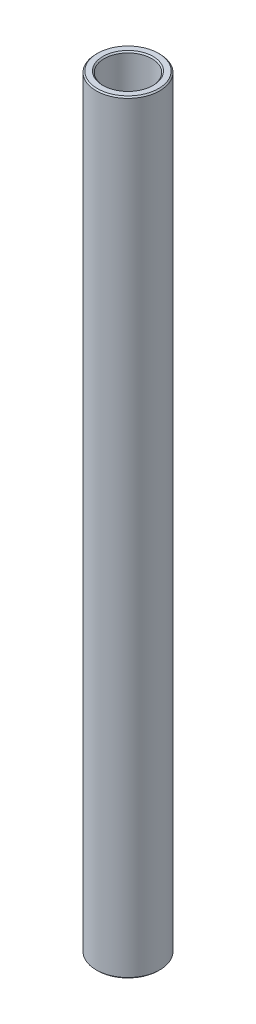
ISO-10303-21;
HEADER;
FILE_DESCRIPTION(('STEP AP214'),'2;1');
FILE_NAME('part.step','',(''),(''),'','','');
FILE_SCHEMA(('AUTOMOTIVE_DESIGN { 1 0 10303 214 1 1 1 1 }'));
ENDSEC;
DATA;
#1=APPLICATION_CONTEXT('core data for automotive mechanical design processes');
#2=APPLICATION_PROTOCOL_DEFINITION('international standard','automotive_design',2000,#1);
#3=PRODUCT_CONTEXT('',#1,'mechanical');
#4=PRODUCT('Part','Part','',(#3));
#5=PRODUCT_RELATED_PRODUCT_CATEGORY('part','',(#4));
#6=PRODUCT_DEFINITION_FORMATION('','',#4);
#7=PRODUCT_DEFINITION_CONTEXT('part definition',#1,'design');
#8=PRODUCT_DEFINITION('design','',#6,#7);
#9=PRODUCT_DEFINITION_SHAPE('','',#8);
#10=(LENGTH_UNIT() NAMED_UNIT(*) SI_UNIT(.MILLI.,.METRE.));
#11=(NAMED_UNIT(*) PLANE_ANGLE_UNIT() SI_UNIT($,.RADIAN.));
#12=(NAMED_UNIT(*) SI_UNIT($,.STERADIAN.) SOLID_ANGLE_UNIT());
#13=UNCERTAINTY_MEASURE_WITH_UNIT(LENGTH_MEASURE(1.E-05),#10,'distance_accuracy_value','');
#14=(GEOMETRIC_REPRESENTATION_CONTEXT(3) GLOBAL_UNCERTAINTY_ASSIGNED_CONTEXT((#13)) GLOBAL_UNIT_ASSIGNED_CONTEXT((#10,
#11,#12)) REPRESENTATION_CONTEXT('',''));
#15=CARTESIAN_POINT('',(0.,0.,0.));
#16=DIRECTION('',(0.,0.,1.));
#17=DIRECTION('',(1.,0.,0.));
#18=AXIS2_PLACEMENT_3D('',#15,#16,#17);
#19=CARTESIAN_POINT('',(0.,11.60859375,0.));
#20=DIRECTION('',(0.,1.,0.));
#21=DIRECTION('',(-1.,0.,0.));
#22=AXIS2_PLACEMENT_3D('',#19,#20,#21);
#23=CYLINDRICAL_SURFACE('',#22,4.76250000000001);
#24=CARTESIAN_POINT('',(0.,-75.946,0.));
#25=DIRECTION('',(0.,1.,0.));
#26=DIRECTION('',(-1.,0.,0.));
#27=AXIS2_PLACEMENT_3D('',#24,#25,#26);
#28=CIRCLE('',#27,4.76250000000001);
#29=CARTESIAN_POINT('',(-4.76250000000002,-75.946,0.));
#30=VERTEX_POINT('',#29);
#31=EDGE_CURVE('E51',#30,#30,#28,.F.);
#32=ORIENTED_EDGE('',*,*,#31,.T.);
#33=EDGE_LOOP('',(#32));
#34=FACE_BOUND('',#33,.T.);
#35=CARTESIAN_POINT('',(0.,75.9460000000001,0.));
#36=DIRECTION('',(0.,-1.,0.));
#37=DIRECTION('',(1.,0.,0.));
#38=AXIS2_PLACEMENT_3D('',#35,#36,#37);
#39=CIRCLE('',#38,4.76250000000001);
#40=CARTESIAN_POINT('',(4.76250000000002,75.9460000000001,0.));
#41=VERTEX_POINT('',#40);
#42=EDGE_CURVE('E54',#41,#41,#39,.F.);
#43=ORIENTED_EDGE('',*,*,#42,.T.);
#44=EDGE_LOOP('',(#43));
#45=FACE_BOUND('',#44,.T.);
#46=ADVANCED_FACE('F31',(#34,#45),#23,.F.);
#47=CARTESIAN_POINT('',(4.7625,76.2,0.));
#48=DIRECTION('',(0.,-1.,0.));
#49=DIRECTION('',(1.,0.,0.));
#50=AXIS2_PLACEMENT_3D('',#47,#48,#49);
#51=PLANE('',#50);
#52=CARTESIAN_POINT('',(0.,76.2,0.));
#53=DIRECTION('',(0.,-1.,0.));
#54=DIRECTION('',(1.,0.,0.));
#55=AXIS2_PLACEMENT_3D('',#52,#53,#54);
#56=CIRCLE('',#55,6.09599999999997);
#57=CARTESIAN_POINT('',(6.09599999999999,76.2,0.));
#58=VERTEX_POINT('',#57);
#59=EDGE_CURVE('E10',#58,#58,#56,.F.);
#60=ORIENTED_EDGE('',*,*,#59,.T.);
#61=EDGE_LOOP('',(#60));
#62=FACE_BOUND('',#61,.T.);
#63=CARTESIAN_POINT('',(0.,76.2,0.));
#64=DIRECTION('',(0.,-1.,0.));
#65=DIRECTION('',(1.,0.,0.));
#66=AXIS2_PLACEMENT_3D('',#63,#64,#65);
#67=CIRCLE('',#66,5.01649999999997);
#68=CARTESIAN_POINT('',(5.01649999999998,76.2,0.));
#69=VERTEX_POINT('',#68);
#70=EDGE_CURVE('E38',#69,#69,#67,.T.);
#71=ORIENTED_EDGE('',*,*,#70,.T.);
#72=EDGE_LOOP('',(#71));
#73=FACE_BOUND('',#72,.T.);
#74=ADVANCED_FACE('F77',(#62,#73),#51,.F.);
#75=CARTESIAN_POINT('',(0.,11.60859375,0.));
#76=DIRECTION('',(0.,1.,0.));
#77=DIRECTION('',(-1.,0.,0.));
#78=AXIS2_PLACEMENT_3D('',#75,#76,#77);
#79=CYLINDRICAL_SURFACE('',#78,6.35);
#80=CARTESIAN_POINT('',(0.,-75.9459999999999,0.));
#81=DIRECTION('',(0.,1.,0.));
#82=DIRECTION('',(-1.,0.,0.));
#83=AXIS2_PLACEMENT_3D('',#80,#81,#82);
#84=CIRCLE('',#83,6.35);
#85=CARTESIAN_POINT('',(-6.35000000000001,-75.9459999999999,0.));
#86=VERTEX_POINT('',#85);
#87=EDGE_CURVE('E42',#86,#86,#84,.T.);
#88=ORIENTED_EDGE('',*,*,#87,.T.);
#89=EDGE_LOOP('',(#88));
#90=FACE_BOUND('',#89,.T.);
#91=CARTESIAN_POINT('',(0.,75.946,0.));
#92=DIRECTION('',(0.,-1.,0.));
#93=DIRECTION('',(1.,0.,0.));
#94=AXIS2_PLACEMENT_3D('',#91,#92,#93);
#95=CIRCLE('',#94,6.35);
#96=CARTESIAN_POINT('',(6.35000000000001,75.946,0.));
#97=VERTEX_POINT('',#96);
#98=EDGE_CURVE('E46',#97,#97,#95,.T.);
#99=ORIENTED_EDGE('',*,*,#98,.T.);
#100=EDGE_LOOP('',(#99));
#101=FACE_BOUND('',#100,.T.);
#102=ADVANCED_FACE('F74',(#90,#101),#79,.T.);
#103=CARTESIAN_POINT('',(6.35000000000001,-76.2,0.));
#104=DIRECTION('',(0.,1.,0.));
#105=DIRECTION('',(-1.,0.,0.));
#106=AXIS2_PLACEMENT_3D('',#103,#104,#105);
#107=PLANE('',#106);
#108=CARTESIAN_POINT('',(0.,-76.2,0.));
#109=DIRECTION('',(0.,1.,0.));
#110=DIRECTION('',(-1.,0.,0.));
#111=AXIS2_PLACEMENT_3D('',#108,#109,#110);
#112=CIRCLE('',#111,5.01650000000003);
#113=CARTESIAN_POINT('',(-5.01650000000004,-76.2,0.));
#114=VERTEX_POINT('',#113);
#115=EDGE_CURVE('E57',#114,#114,#112,.T.);
#116=ORIENTED_EDGE('',*,*,#115,.T.);
#117=EDGE_LOOP('',(#116));
#118=FACE_BOUND('',#117,.T.);
#119=CARTESIAN_POINT('',(0.,-76.2,0.));
#120=DIRECTION('',(0.,1.,0.));
#121=DIRECTION('',(-1.,0.,0.));
#122=AXIS2_PLACEMENT_3D('',#119,#120,#121);
#123=CIRCLE('',#122,6.09599999999993);
#124=CARTESIAN_POINT('',(-6.09599999999994,-76.2,0.));
#125=VERTEX_POINT('',#124);
#126=EDGE_CURVE('E60',#125,#125,#123,.F.);
#127=ORIENTED_EDGE('',*,*,#126,.T.);
#128=EDGE_LOOP('',(#127));
#129=FACE_BOUND('',#128,.T.);
#130=ADVANCED_FACE('F64',(#118,#129),#107,.F.);
#131=CARTESIAN_POINT('',(0.,-76.2,0.));
#132=DIRECTION('',(0.,-1.,0.));
#133=DIRECTION('',(1.,0.,0.));
#134=AXIS2_PLACEMENT_3D('',#131,#132,#133);
#135=CONICAL_SURFACE('',#134,5.01650000000003,0.785398163397433);
#136=ORIENTED_EDGE('',*,*,#31,.F.);
#137=EDGE_LOOP('',(#136));
#138=FACE_BOUND('',#137,.T.);
#139=ORIENTED_EDGE('',*,*,#115,.F.);
#140=EDGE_LOOP('',(#139));
#141=FACE_BOUND('',#140,.T.);
#142=ADVANCED_FACE('F70',(#138,#141),#135,.F.);
#143=CARTESIAN_POINT('',(0.,-75.9459999999999,0.));
#144=DIRECTION('',(0.,1.,0.));
#145=DIRECTION('',(-1.,0.,0.));
#146=AXIS2_PLACEMENT_3D('',#143,#144,#145);
#147=CONICAL_SURFACE('',#146,6.35,0.785398163397431);
#148=ORIENTED_EDGE('',*,*,#126,.F.);
#149=EDGE_LOOP('',(#148));
#150=FACE_BOUND('',#149,.T.);
#151=ORIENTED_EDGE('',*,*,#87,.F.);
#152=EDGE_LOOP('',(#151));
#153=FACE_BOUND('',#152,.T.);
#154=ADVANCED_FACE('F66',(#150,#153),#147,.T.);
#155=CARTESIAN_POINT('',(0.,76.2,0.));
#156=DIRECTION('',(0.,-1.,0.));
#157=DIRECTION('',(1.,0.,0.));
#158=AXIS2_PLACEMENT_3D('',#155,#156,#157);
#159=CONICAL_SURFACE('',#158,6.09599999999998,0.785398163397458);
#160=ORIENTED_EDGE('',*,*,#98,.F.);
#161=EDGE_LOOP('',(#160));
#162=FACE_BOUND('',#161,.T.);
#163=ORIENTED_EDGE('',*,*,#59,.F.);
#164=EDGE_LOOP('',(#163));
#165=FACE_BOUND('',#164,.T.);
#166=ADVANCED_FACE('F69',(#162,#165),#159,.T.);
#167=CARTESIAN_POINT('',(0.,75.9460000000001,0.));
#168=DIRECTION('',(0.,1.,0.));
#169=DIRECTION('',(-1.,0.,0.));
#170=AXIS2_PLACEMENT_3D('',#167,#168,#169);
#171=CONICAL_SURFACE('',#170,4.76250000000001,0.78539816339746);
#172=ORIENTED_EDGE('',*,*,#70,.F.);
#173=EDGE_LOOP('',(#172));
#174=FACE_BOUND('',#173,.T.);
#175=ORIENTED_EDGE('',*,*,#42,.F.);
#176=EDGE_LOOP('',(#175));
#177=FACE_BOUND('',#176,.T.);
#178=ADVANCED_FACE('F33',(#174,#177),#171,.F.);
#179=CLOSED_SHELL('',(#46,#74,#102,#130,#142,#154,#166,#178));
#180=MANIFOLD_SOLID_BREP('B2',#179);
#181=ADVANCED_BREP_SHAPE_REPRESENTATION('',(#18,#180),#14);
#182=SHAPE_DEFINITION_REPRESENTATION(#9,#181);
ENDSEC;
END-ISO-10303-21;
